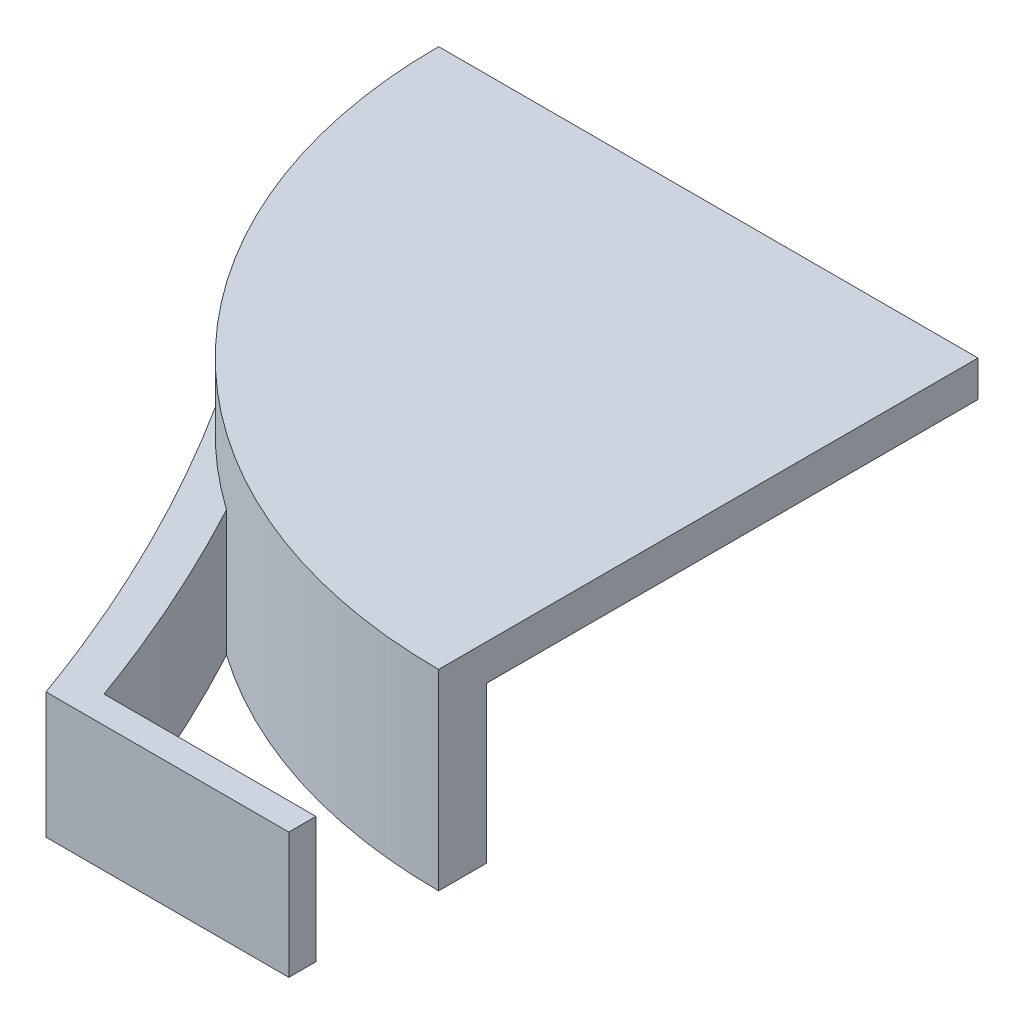
ISO-10303-21;
HEADER;
FILE_DESCRIPTION(('STEP AP214'),'2;1');
FILE_NAME('part.step','',(''),(''),'','','');
FILE_SCHEMA(('AUTOMOTIVE_DESIGN { 1 0 10303 214 1 1 1 1 }'));
ENDSEC;
DATA;
#1=APPLICATION_CONTEXT('core data for automotive mechanical design processes');
#2=APPLICATION_PROTOCOL_DEFINITION('international standard','automotive_design',2000,#1);
#3=PRODUCT_CONTEXT('',#1,'mechanical');
#4=PRODUCT('Part','Part','',(#3));
#5=PRODUCT_RELATED_PRODUCT_CATEGORY('part','',(#4));
#6=PRODUCT_DEFINITION_FORMATION('','',#4);
#7=PRODUCT_DEFINITION_CONTEXT('part definition',#1,'design');
#8=PRODUCT_DEFINITION('design','',#6,#7);
#9=PRODUCT_DEFINITION_SHAPE('','',#8);
#10=(LENGTH_UNIT() NAMED_UNIT(*) SI_UNIT(.MILLI.,.METRE.));
#11=(NAMED_UNIT(*) PLANE_ANGLE_UNIT() SI_UNIT($,.RADIAN.));
#12=(NAMED_UNIT(*) SI_UNIT($,.STERADIAN.) SOLID_ANGLE_UNIT());
#13=UNCERTAINTY_MEASURE_WITH_UNIT(LENGTH_MEASURE(1.E-05),#10,'distance_accuracy_value','');
#14=(GEOMETRIC_REPRESENTATION_CONTEXT(3) GLOBAL_UNCERTAINTY_ASSIGNED_CONTEXT((#13)) GLOBAL_UNIT_ASSIGNED_CONTEXT((#10,
#11,#12)) REPRESENTATION_CONTEXT('',''));
#15=CARTESIAN_POINT('',(0.,0.,0.));
#16=DIRECTION('',(0.,0.,1.));
#17=DIRECTION('',(1.,0.,0.));
#18=AXIS2_PLACEMENT_3D('',#15,#16,#17);
#19=CARTESIAN_POINT('',(0.,6.4,0.));
#20=DIRECTION('',(0.,-1.,0.));
#21=DIRECTION('',(0.,0.,-1.));
#22=AXIS2_PLACEMENT_3D('',#19,#20,#21);
#23=CYLINDRICAL_SURFACE('',#22,18.);
#24=DIRECTION('',(0.,-1.,0.));
#25=VECTOR('',#24,1.);
#26=CARTESIAN_POINT('',(-13.6085419349561,4.2,11.7816631425508));
#27=LINE('',#26,#25);
#28=CARTESIAN_POINT('',(-13.6085419349561,4.2,11.7816631425508));
#29=VERTEX_POINT('',#28);
#30=CARTESIAN_POINT('',(-13.6085419349561,0.,11.7816631425508));
#31=VERTEX_POINT('',#30);
#32=EDGE_CURVE('E60',#29,#31,#27,.T.);
#33=ORIENTED_EDGE('',*,*,#32,.F.);
#34=CARTESIAN_POINT('',(0.,4.2,0.));
#35=DIRECTION('',(0.,-1.,0.));
#36=DIRECTION('',(0.,0.,-1.));
#37=AXIS2_PLACEMENT_3D('',#34,#35,#36);
#38=CIRCLE('',#37,18.);
#39=CARTESIAN_POINT('',(-10.353735644318,4.2,14.7241352278353));
#40=VERTEX_POINT('',#39);
#41=EDGE_CURVE('E65',#40,#29,#38,.T.);
#42=ORIENTED_EDGE('',*,*,#41,.F.);
#43=DIRECTION('',(0.,-1.,0.));
#44=VECTOR('',#43,1.);
#45=CARTESIAN_POINT('',(-10.353735644318,4.2,14.7241352278353));
#46=LINE('',#45,#44);
#47=CARTESIAN_POINT('',(-10.353735644318,0.,14.7241352278353));
#48=VERTEX_POINT('',#47);
#49=EDGE_CURVE('E140',#40,#48,#46,.T.);
#50=ORIENTED_EDGE('',*,*,#49,.T.);
#51=CARTESIAN_POINT('',(0.,0.,0.));
#52=DIRECTION('',(0.,1.,0.));
#53=DIRECTION('',(0.,0.,1.));
#54=AXIS2_PLACEMENT_3D('',#51,#52,#53);
#55=CIRCLE('',#54,18.);
#56=CARTESIAN_POINT('',(0.,0.,18.));
#57=VERTEX_POINT('',#56);
#58=EDGE_CURVE('E363',#48,#57,#55,.T.);
#59=ORIENTED_EDGE('',*,*,#58,.T.);
#60=DIRECTION('',(0.,-1.,0.));
#61=VECTOR('',#60,1.);
#62=CARTESIAN_POINT('',(0.,6.4,18.));
#63=LINE('',#62,#61);
#64=CARTESIAN_POINT('',(0.,6.4,18.));
#65=VERTEX_POINT('',#64);
#66=EDGE_CURVE('E337',#57,#65,#63,.F.);
#67=ORIENTED_EDGE('',*,*,#66,.T.);
#68=CARTESIAN_POINT('',(0.,6.4,0.));
#69=DIRECTION('',(0.,1.,0.));
#70=DIRECTION('',(0.,0.,1.));
#71=AXIS2_PLACEMENT_3D('',#68,#69,#70);
#72=CIRCLE('',#71,18.);
#73=CARTESIAN_POINT('',(-18.,6.4,0.));
#74=VERTEX_POINT('',#73);
#75=EDGE_CURVE('E364',#74,#65,#72,.T.);
#76=ORIENTED_EDGE('',*,*,#75,.F.);
#77=DIRECTION('',(0.,-1.,0.));
#78=VECTOR('',#77,1.);
#79=CARTESIAN_POINT('',(-18.,6.4,0.));
#80=LINE('',#79,#78);
#81=CARTESIAN_POINT('',(-18.,0.,0.));
#82=VERTEX_POINT('',#81);
#83=EDGE_CURVE('E352',#74,#82,#80,.T.);
#84=ORIENTED_EDGE('',*,*,#83,.T.);
#85=EDGE_CURVE('E368',#82,#31,#55,.T.);
#86=ORIENTED_EDGE('',*,*,#85,.T.);
#87=EDGE_LOOP('',(#33,#42,#50,#59,#67,#76,#84,#86));
#88=FACE_BOUND('',#87,.T.);
#89=ADVANCED_FACE('F45',(#88),#23,.T.);
#90=CARTESIAN_POINT('',(0.,6.4,0.));
#91=DIRECTION('',(0.,-1.,0.));
#92=DIRECTION('',(0.,0.,-1.));
#93=AXIS2_PLACEMENT_3D('',#90,#91,#92);
#94=CYLINDRICAL_SURFACE('',#93,16.4);
#95=DIRECTION('',(0.,-1.,0.));
#96=VECTOR('',#95,1.);
#97=CARTESIAN_POINT('',(0.,6.4,16.4));
#98=LINE('',#97,#96);
#99=CARTESIAN_POINT('',(0.,0.,16.4));
#100=VERTEX_POINT('',#99);
#101=CARTESIAN_POINT('',(0.,5.2,16.4));
#102=VERTEX_POINT('',#101);
#103=EDGE_CURVE('E330',#100,#102,#98,.F.);
#104=ORIENTED_EDGE('',*,*,#103,.F.);
#105=CARTESIAN_POINT('',(0.,0.,0.));
#106=DIRECTION('',(0.,1.,0.));
#107=DIRECTION('',(0.,0.,1.));
#108=AXIS2_PLACEMENT_3D('',#105,#106,#107);
#109=CIRCLE('',#108,16.4);
#110=CARTESIAN_POINT('',(-16.4,0.,0.));
#111=VERTEX_POINT('',#110);
#112=EDGE_CURVE('E360',#111,#100,#109,.T.);
#113=ORIENTED_EDGE('',*,*,#112,.F.);
#114=DIRECTION('',(0.,-1.,0.));
#115=VECTOR('',#114,1.);
#116=CARTESIAN_POINT('',(-16.4,6.4,0.));
#117=LINE('',#116,#115);
#118=CARTESIAN_POINT('',(-16.4,5.2,0.));
#119=VERTEX_POINT('',#118);
#120=EDGE_CURVE('E345',#119,#111,#117,.T.);
#121=ORIENTED_EDGE('',*,*,#120,.F.);
#122=CARTESIAN_POINT('',(0.,5.2,0.));
#123=DIRECTION('',(0.,1.,0.));
#124=DIRECTION('',(0.,0.,1.));
#125=AXIS2_PLACEMENT_3D('',#122,#123,#124);
#126=CIRCLE('',#125,16.4);
#127=EDGE_CURVE('E356',#119,#102,#126,.T.);
#128=ORIENTED_EDGE('',*,*,#127,.T.);
#129=EDGE_LOOP('',(#104,#113,#121,#128));
#130=FACE_BOUND('',#129,.T.);
#131=ADVANCED_FACE('F184',(#130),#94,.F.);
#132=CARTESIAN_POINT('',(0.,6.4,0.));
#133=DIRECTION('',(0.,1.,0.));
#134=DIRECTION('',(0.,0.,1.));
#135=AXIS2_PLACEMENT_3D('',#132,#133,#134);
#136=PLANE('',#135);
#137=DIRECTION('',(0.,0.,1.));
#138=VECTOR('',#137,1.);
#139=CARTESIAN_POINT('',(0.,6.4,0.));
#140=LINE('',#139,#138);
#141=CARTESIAN_POINT('',(0.,6.4,0.));
#142=VERTEX_POINT('',#141);
#143=EDGE_CURVE('E313',#142,#65,#140,.T.);
#144=ORIENTED_EDGE('',*,*,#143,.F.);
#145=DIRECTION('',(1.,0.,0.));
#146=VECTOR('',#145,1.);
#147=CARTESIAN_POINT('',(0.,6.4,0.));
#148=LINE('',#147,#146);
#149=EDGE_CURVE('E341',#74,#142,#148,.T.);
#150=ORIENTED_EDGE('',*,*,#149,.F.);
#151=ORIENTED_EDGE('',*,*,#75,.T.);
#152=EDGE_LOOP('',(#144,#150,#151));
#153=FACE_BOUND('',#152,.T.);
#154=ADVANCED_FACE('F187',(#153),#136,.T.);
#155=CARTESIAN_POINT('',(0.,0.,0.));
#156=DIRECTION('',(0.,1.,0.));
#157=DIRECTION('',(0.,0.,1.));
#158=AXIS2_PLACEMENT_3D('',#155,#156,#157);
#159=PLANE('',#158);
#160=ORIENTED_EDGE('',*,*,#112,.T.);
#161=DIRECTION('',(0.,0.,1.));
#162=VECTOR('',#161,1.);
#163=CARTESIAN_POINT('',(0.,0.,0.));
#164=LINE('',#163,#162);
#165=EDGE_CURVE('E333',#100,#57,#164,.T.);
#166=ORIENTED_EDGE('',*,*,#165,.T.);
#167=ORIENTED_EDGE('',*,*,#58,.F.);
#168=CARTESIAN_POINT('',(-10.3537356443179,0.,14.7241352278351));
#169=CARTESIAN_POINT('',(-9.0587570763711,0.,17.1431541450541));
#170=CARTESIAN_POINT('',(-7.94917085294343,0.,19.6431895751301));
#171=CARTESIAN_POINT('',(-7.02497697424158,0.,22.2242415175125));
#172=B_SPLINE_CURVE_WITH_KNOTS('',3,(#168,#169,#170,#171),.UNSPECIFIED.,.F.,.F.,(4,4),
(0.464158141402385,0.927765660753905),.UNSPECIFIED.);
#173=CARTESIAN_POINT('',(-7.0714540558281,0.,22.0949435729996));
#174=VERTEX_POINT('',#173);
#175=EDGE_CURVE('E282',#48,#174,#172,.T.);
#176=ORIENTED_EDGE('',*,*,#175,.T.);
#177=DIRECTION('',(1.,0.,0.));
#178=VECTOR('',#177,1.);
#179=CARTESIAN_POINT('',(0.,0.,22.0949435729996));
#180=LINE('',#179,#178);
#181=CARTESIAN_POINT('',(0.,0.,22.0949435729996));
#182=VERTEX_POINT('',#181);
#183=EDGE_CURVE('E133',#174,#182,#180,.T.);
#184=ORIENTED_EDGE('',*,*,#183,.T.);
#185=DIRECTION('',(0.,0.,1.));
#186=VECTOR('',#185,1.);
#187=CARTESIAN_POINT('',(0.,0.,0.));
#188=LINE('',#187,#186);
#189=CARTESIAN_POINT('',(0.,0.,23.));
#190=VERTEX_POINT('',#189);
#191=EDGE_CURVE('E295',#182,#190,#188,.T.);
#192=ORIENTED_EDGE('',*,*,#191,.T.);
#193=DIRECTION('',(-1.,0.,0.));
#194=VECTOR('',#193,1.);
#195=CARTESIAN_POINT('',(0.,0.,23.));
#196=LINE('',#195,#194);
#197=CARTESIAN_POINT('',(-8.10267309138816,0.,23.));
#198=VERTEX_POINT('',#197);
#199=EDGE_CURVE('E299',#190,#198,#196,.T.);
#200=ORIENTED_EDGE('',*,*,#199,.T.);
#201=CARTESIAN_POINT('',(-13.608541934956,0.,11.7816631425507));
#202=CARTESIAN_POINT('',(-11.344094103267,0.,15.3335664857446));
#203=CARTESIAN_POINT('',(-9.50880448849023,0.,19.0730121056059));
#204=CARTESIAN_POINT('',(-8.10267309138816,0.,23.));
#205=B_SPLINE_CURVE_WITH_KNOTS('',3,(#201,#202,#203,#204),.UNSPECIFIED.,.F.,.F.,(4,4),
(0.222401663095274,0.927765660753905),.UNSPECIFIED.);
#206=EDGE_CURVE('E156',#31,#198,#205,.T.);
#207=ORIENTED_EDGE('',*,*,#206,.F.);
#208=ORIENTED_EDGE('',*,*,#85,.F.);
#209=DIRECTION('',(1.,0.,0.));
#210=VECTOR('',#209,1.);
#211=CARTESIAN_POINT('',(0.,0.,0.));
#212=LINE('',#211,#210);
#213=EDGE_CURVE('E348',#82,#111,#212,.T.);
#214=ORIENTED_EDGE('',*,*,#213,.T.);
#215=EDGE_LOOP('',(#160,#166,#167,#176,#184,#192,#200,#207,#208,#214));
#216=FACE_BOUND('',#215,.T.);
#217=ADVANCED_FACE('F182',(#216),#159,.F.);
#218=CARTESIAN_POINT('',(0.,5.2,0.));
#219=DIRECTION('',(0.,1.,0.));
#220=DIRECTION('',(0.,0.,1.));
#221=AXIS2_PLACEMENT_3D('',#218,#219,#220);
#222=PLANE('',#221);
#223=DIRECTION('',(1.,0.,0.));
#224=VECTOR('',#223,1.);
#225=CARTESIAN_POINT('',(0.,5.2,0.));
#226=LINE('',#225,#224);
#227=CARTESIAN_POINT('',(0.,5.2,0.));
#228=VERTEX_POINT('',#227);
#229=EDGE_CURVE('E53',#119,#228,#226,.T.);
#230=ORIENTED_EDGE('',*,*,#229,.T.);
#231=DIRECTION('',(0.,0.,1.));
#232=VECTOR('',#231,1.);
#233=CARTESIAN_POINT('',(0.,5.2,0.));
#234=LINE('',#233,#232);
#235=EDGE_CURVE('E326',#228,#102,#234,.T.);
#236=ORIENTED_EDGE('',*,*,#235,.T.);
#237=ORIENTED_EDGE('',*,*,#127,.F.);
#238=EDGE_LOOP('',(#230,#236,#237));
#239=FACE_BOUND('',#238,.T.);
#240=ADVANCED_FACE('F178',(#239),#222,.F.);
#241=CARTESIAN_POINT('',(0.,-2.8,0.));
#242=DIRECTION('',(0.,0.,1.));
#243=DIRECTION('',(1.,0.,0.));
#244=AXIS2_PLACEMENT_3D('',#241,#242,#243);
#245=PLANE('',#244);
#246=ORIENTED_EDGE('',*,*,#149,.T.);
#247=DIRECTION('',(0.,-1.,0.));
#248=VECTOR('',#247,1.);
#249=CARTESIAN_POINT('',(0.,-2.8,0.));
#250=LINE('',#249,#248);
#251=EDGE_CURVE('E11',#142,#228,#250,.T.);
#252=ORIENTED_EDGE('',*,*,#251,.T.);
#253=ORIENTED_EDGE('',*,*,#229,.F.);
#254=ORIENTED_EDGE('',*,*,#120,.T.);
#255=ORIENTED_EDGE('',*,*,#213,.F.);
#256=ORIENTED_EDGE('',*,*,#83,.F.);
#257=EDGE_LOOP('',(#246,#252,#253,#254,#255,#256));
#258=FACE_BOUND('',#257,.T.);
#259=ADVANCED_FACE('F174',(#258),#245,.F.);
#260=CARTESIAN_POINT('',(0.,-2.8,0.));
#261=DIRECTION('',(-1.,0.,0.));
#262=DIRECTION('',(0.,0.,1.));
#263=AXIS2_PLACEMENT_3D('',#260,#261,#262);
#264=PLANE('',#263);
#265=ORIENTED_EDGE('',*,*,#165,.F.);
#266=ORIENTED_EDGE('',*,*,#103,.T.);
#267=ORIENTED_EDGE('',*,*,#235,.F.);
#268=ORIENTED_EDGE('',*,*,#251,.F.);
#269=ORIENTED_EDGE('',*,*,#143,.T.);
#270=ORIENTED_EDGE('',*,*,#66,.F.);
#271=EDGE_LOOP('',(#265,#266,#267,#268,#269,#270));
#272=FACE_BOUND('',#271,.T.);
#273=ADVANCED_FACE('F170',(#272),#264,.F.);
#274=CARTESIAN_POINT('',(-13.608541934956,4.2,11.7816631425507));
#275=CARTESIAN_POINT('',(-11.344094103267,4.2,15.3335664857446));
#276=CARTESIAN_POINT('',(-9.50880448849023,4.2,19.0730121056059));
#277=CARTESIAN_POINT('',(-8.10267309138816,4.2,23.));
#278=B_SPLINE_CURVE_WITH_KNOTS('',3,(#274,#275,#276,#277),.UNSPECIFIED.,.F.,.F.,(4,4),
(0.222401663095274,0.927765660753905),.UNSPECIFIED.);
#279=DIRECTION('',(0.,-1.,0.));
#280=VECTOR('',#279,1.);
#281=SURFACE_OF_LINEAR_EXTRUSION('',#278,#280);
#282=ORIENTED_EDGE('',*,*,#206,.T.);
#283=DIRECTION('',(0.,-1.,0.));
#284=VECTOR('',#283,1.);
#285=CARTESIAN_POINT('',(-8.10267309138816,4.2,23.));
#286=LINE('',#285,#284);
#287=CARTESIAN_POINT('',(-8.10267309138816,4.2,23.));
#288=VERTEX_POINT('',#287);
#289=EDGE_CURVE('E314',#288,#198,#286,.T.);
#290=ORIENTED_EDGE('',*,*,#289,.F.);
#291=EDGE_CURVE('E274',#29,#288,#278,.T.);
#292=ORIENTED_EDGE('',*,*,#291,.F.);
#293=ORIENTED_EDGE('',*,*,#32,.T.);
#294=EDGE_LOOP('',(#282,#290,#292,#293));
#295=FACE_BOUND('',#294,.T.);
#296=ADVANCED_FACE('F173',(#295),#281,.F.);
#297=CARTESIAN_POINT('',(0.,4.2,23.));
#298=DIRECTION('',(0.,0.,1.));
#299=DIRECTION('',(1.,0.,0.));
#300=AXIS2_PLACEMENT_3D('',#297,#298,#299);
#301=PLANE('',#300);
#302=ORIENTED_EDGE('',*,*,#199,.F.);
#303=DIRECTION('',(0.,-1.,0.));
#304=VECTOR('',#303,1.);
#305=CARTESIAN_POINT('',(0.,4.2,23.));
#306=LINE('',#305,#304);
#307=CARTESIAN_POINT('',(0.,4.2,23.));
#308=VERTEX_POINT('',#307);
#309=EDGE_CURVE('E317',#308,#190,#306,.T.);
#310=ORIENTED_EDGE('',*,*,#309,.F.);
#311=DIRECTION('',(-1.,0.,0.));
#312=VECTOR('',#311,1.);
#313=CARTESIAN_POINT('',(0.,4.2,23.));
#314=LINE('',#313,#312);
#315=EDGE_CURVE('E281',#308,#288,#314,.T.);
#316=ORIENTED_EDGE('',*,*,#315,.T.);
#317=ORIENTED_EDGE('',*,*,#289,.T.);
#318=EDGE_LOOP('',(#302,#310,#316,#317));
#319=FACE_BOUND('',#318,.T.);
#320=ADVANCED_FACE('F218',(#319),#301,.T.);
#321=CARTESIAN_POINT('',(0.,4.2,0.));
#322=DIRECTION('',(1.,0.,0.));
#323=DIRECTION('',(0.,0.,-1.));
#324=AXIS2_PLACEMENT_3D('',#321,#322,#323);
#325=PLANE('',#324);
#326=ORIENTED_EDGE('',*,*,#191,.F.);
#327=DIRECTION('',(0.,-1.,0.));
#328=VECTOR('',#327,1.);
#329=CARTESIAN_POINT('',(0.,4.2,22.0949435729996));
#330=LINE('',#329,#328);
#331=CARTESIAN_POINT('',(0.,4.2,22.0949435729996));
#332=VERTEX_POINT('',#331);
#333=EDGE_CURVE('E139',#332,#182,#330,.T.);
#334=ORIENTED_EDGE('',*,*,#333,.F.);
#335=DIRECTION('',(0.,0.,1.));
#336=VECTOR('',#335,1.);
#337=CARTESIAN_POINT('',(0.,4.2,0.));
#338=LINE('',#337,#336);
#339=EDGE_CURVE('E149',#332,#308,#338,.T.);
#340=ORIENTED_EDGE('',*,*,#339,.T.);
#341=ORIENTED_EDGE('',*,*,#309,.T.);
#342=EDGE_LOOP('',(#326,#334,#340,#341));
#343=FACE_BOUND('',#342,.T.);
#344=ADVANCED_FACE('F228',(#343),#325,.T.);
#345=CARTESIAN_POINT('',(0.,4.2,22.0949435729996));
#346=DIRECTION('',(0.,0.,-1.));
#347=DIRECTION('',(-1.,0.,0.));
#348=AXIS2_PLACEMENT_3D('',#345,#346,#347);
#349=PLANE('',#348);
#350=ORIENTED_EDGE('',*,*,#183,.F.);
#351=DIRECTION('',(0.,-1.,0.));
#352=VECTOR('',#351,1.);
#353=CARTESIAN_POINT('',(-7.0714540558281,4.2,22.0949435729996));
#354=LINE('',#353,#352);
#355=CARTESIAN_POINT('',(-7.0714540558281,4.2,22.0949435729996));
#356=VERTEX_POINT('',#355);
#357=EDGE_CURVE('E128',#356,#174,#354,.T.);
#358=ORIENTED_EDGE('',*,*,#357,.F.);
#359=DIRECTION('',(1.,0.,0.));
#360=VECTOR('',#359,1.);
#361=CARTESIAN_POINT('',(0.,4.2,22.0949435729996));
#362=LINE('',#361,#360);
#363=EDGE_CURVE('E131',#356,#332,#362,.T.);
#364=ORIENTED_EDGE('',*,*,#363,.T.);
#365=ORIENTED_EDGE('',*,*,#333,.T.);
#366=EDGE_LOOP('',(#350,#358,#364,#365));
#367=FACE_BOUND('',#366,.T.);
#368=ADVANCED_FACE('F130',(#367),#349,.T.);
#369=CARTESIAN_POINT('',(-10.3537356443179,4.2,14.7241352278351));
#370=CARTESIAN_POINT('',(-9.0587570763711,4.2,17.1431541450541));
#371=CARTESIAN_POINT('',(-7.94917085294343,4.2,19.6431895751301));
#372=CARTESIAN_POINT('',(-7.02497697424158,4.2,22.2242415175125));
#373=B_SPLINE_CURVE_WITH_KNOTS('',3,(#369,#370,#371,#372),.UNSPECIFIED.,.F.,.F.,(4,4),
(0.464158141402385,0.927765660753905),.UNSPECIFIED.);
#374=DIRECTION('',(0.,-1.,0.));
#375=VECTOR('',#374,1.);
#376=SURFACE_OF_LINEAR_EXTRUSION('',#373,#375);
#377=ORIENTED_EDGE('',*,*,#175,.F.);
#378=ORIENTED_EDGE('',*,*,#49,.F.);
#379=EDGE_CURVE('E146',#40,#356,#373,.T.);
#380=ORIENTED_EDGE('',*,*,#379,.T.);
#381=ORIENTED_EDGE('',*,*,#357,.T.);
#382=EDGE_LOOP('',(#377,#378,#380,#381));
#383=FACE_BOUND('',#382,.T.);
#384=ADVANCED_FACE('F152',(#383),#376,.T.);
#385=CARTESIAN_POINT('',(0.,4.2,0.));
#386=DIRECTION('',(0.,-1.,0.));
#387=DIRECTION('',(0.,0.,-1.));
#388=AXIS2_PLACEMENT_3D('',#385,#386,#387);
#389=PLANE('',#388);
#390=ORIENTED_EDGE('',*,*,#41,.T.);
#391=ORIENTED_EDGE('',*,*,#291,.T.);
#392=ORIENTED_EDGE('',*,*,#315,.F.);
#393=ORIENTED_EDGE('',*,*,#339,.F.);
#394=ORIENTED_EDGE('',*,*,#363,.F.);
#395=ORIENTED_EDGE('',*,*,#379,.F.);
#396=EDGE_LOOP('',(#390,#391,#392,#393,#394,#395));
#397=FACE_BOUND('',#396,.T.);
#398=ADVANCED_FACE('F145',(#397),#389,.F.);
#399=CLOSED_SHELL('',(#89,#131,#154,#217,#240,#259,#273,#296,#320,#344,#368,#384,#398));
#400=MANIFOLD_SOLID_BREP('B2',#399);
#401=ADVANCED_BREP_SHAPE_REPRESENTATION('',(#18,#400),#14);
#402=SHAPE_DEFINITION_REPRESENTATION(#9,#401);
ENDSEC;
END-ISO-10303-21;
